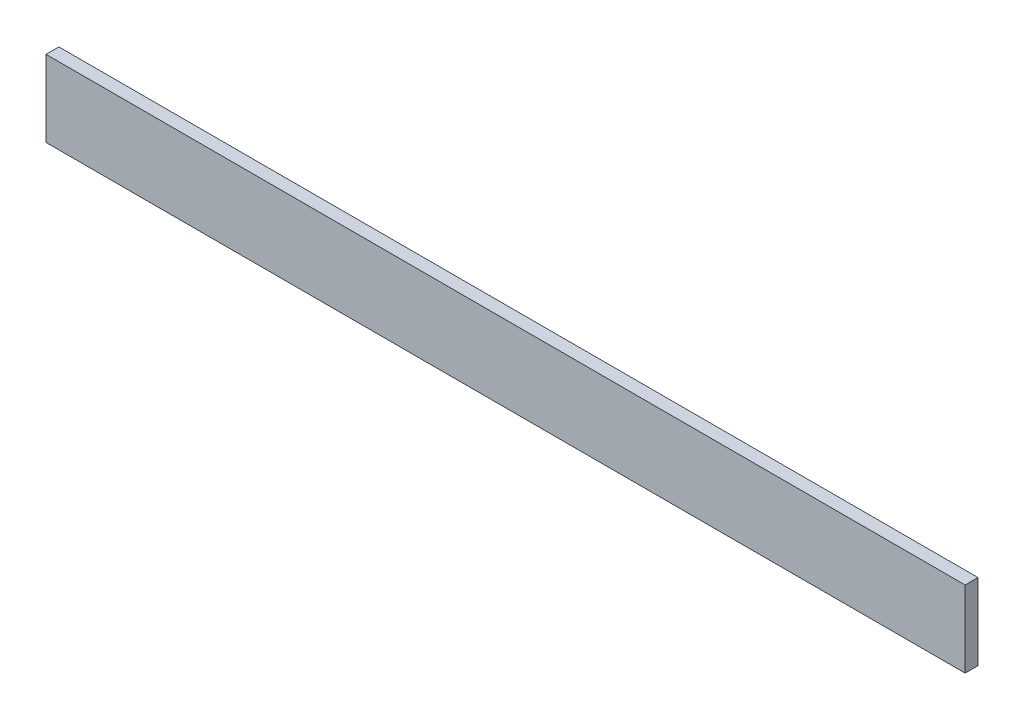
ISO-10303-21;
HEADER;
FILE_DESCRIPTION(('STEP AP214'),'2;1');
FILE_NAME('part.step','',(''),(''),'','','');
FILE_SCHEMA(('AUTOMOTIVE_DESIGN { 1 0 10303 214 1 1 1 1 }'));
ENDSEC;
DATA;
#1=APPLICATION_CONTEXT('core data for automotive mechanical design processes');
#2=APPLICATION_PROTOCOL_DEFINITION('international standard','automotive_design',2000,#1);
#3=PRODUCT_CONTEXT('',#1,'mechanical');
#4=PRODUCT('Part','Part','',(#3));
#5=PRODUCT_RELATED_PRODUCT_CATEGORY('part','',(#4));
#6=PRODUCT_DEFINITION_FORMATION('','',#4);
#7=PRODUCT_DEFINITION_CONTEXT('part definition',#1,'design');
#8=PRODUCT_DEFINITION('design','',#6,#7);
#9=PRODUCT_DEFINITION_SHAPE('','',#8);
#10=(LENGTH_UNIT() NAMED_UNIT(*) SI_UNIT(.MILLI.,.METRE.));
#11=(NAMED_UNIT(*) PLANE_ANGLE_UNIT() SI_UNIT($,.RADIAN.));
#12=(NAMED_UNIT(*) SI_UNIT($,.STERADIAN.) SOLID_ANGLE_UNIT());
#13=UNCERTAINTY_MEASURE_WITH_UNIT(LENGTH_MEASURE(1.E-05),#10,'distance_accuracy_value','');
#14=(GEOMETRIC_REPRESENTATION_CONTEXT(3) GLOBAL_UNCERTAINTY_ASSIGNED_CONTEXT((#13)) GLOBAL_UNIT_ASSIGNED_CONTEXT((#10,
#11,#12)) REPRESENTATION_CONTEXT('',''));
#15=CARTESIAN_POINT('',(0.,0.,0.));
#16=DIRECTION('',(0.,0.,1.));
#17=DIRECTION('',(1.,0.,0.));
#18=AXIS2_PLACEMENT_3D('',#15,#16,#17);
#19=CARTESIAN_POINT('',(107.061,8.89,3.));
#20=DIRECTION('',(-1.,0.,0.));
#21=DIRECTION('',(0.,-1.,0.));
#22=AXIS2_PLACEMENT_3D('',#19,#20,#21);
#23=PLANE('',#22);
#24=DIRECTION('',(0.,1.,0.));
#25=VECTOR('',#24,1.);
#26=CARTESIAN_POINT('',(107.061,8.89,0.));
#27=LINE('',#26,#25);
#28=CARTESIAN_POINT('',(107.061,-8.89,0.));
#29=VERTEX_POINT('',#28);
#30=CARTESIAN_POINT('',(107.061,8.89,0.));
#31=VERTEX_POINT('',#30);
#32=EDGE_CURVE('E95',#29,#31,#27,.T.);
#33=ORIENTED_EDGE('',*,*,#32,.T.);
#34=DIRECTION('',(0.,0.,-1.));
#35=VECTOR('',#34,1.);
#36=CARTESIAN_POINT('',(107.061,8.89,3.));
#37=LINE('',#36,#35);
#38=CARTESIAN_POINT('',(107.061,8.89,3.));
#39=VERTEX_POINT('',#38);
#40=EDGE_CURVE('E11',#39,#31,#37,.T.);
#41=ORIENTED_EDGE('',*,*,#40,.F.);
#42=DIRECTION('',(0.,1.,0.));
#43=VECTOR('',#42,1.);
#44=CARTESIAN_POINT('',(107.061,8.89,3.));
#45=LINE('',#44,#43);
#46=CARTESIAN_POINT('',(107.061,-8.89,3.));
#47=VERTEX_POINT('',#46);
#48=EDGE_CURVE('E83',#47,#39,#45,.T.);
#49=ORIENTED_EDGE('',*,*,#48,.F.);
#50=DIRECTION('',(0.,0.,-1.));
#51=VECTOR('',#50,1.);
#52=CARTESIAN_POINT('',(107.061,-8.89,3.));
#53=LINE('',#52,#51);
#54=EDGE_CURVE('E91',#47,#29,#53,.T.);
#55=ORIENTED_EDGE('',*,*,#54,.T.);
#56=EDGE_LOOP('',(#33,#41,#49,#55));
#57=FACE_BOUND('',#56,.T.);
#58=ADVANCED_FACE('F32',(#57),#23,.F.);
#59=CARTESIAN_POINT('',(-107.061,8.89,3.));
#60=DIRECTION('',(0.,-1.,0.));
#61=DIRECTION('',(0.,0.,-1.));
#62=AXIS2_PLACEMENT_3D('',#59,#60,#61);
#63=PLANE('',#62);
#64=DIRECTION('',(-1.,0.,0.));
#65=VECTOR('',#64,1.);
#66=CARTESIAN_POINT('',(-107.061,8.89,0.));
#67=LINE('',#66,#65);
#68=CARTESIAN_POINT('',(-107.061,8.89,0.));
#69=VERTEX_POINT('',#68);
#70=EDGE_CURVE('E87',#31,#69,#67,.T.);
#71=ORIENTED_EDGE('',*,*,#70,.T.);
#72=DIRECTION('',(0.,0.,-1.));
#73=VECTOR('',#72,1.);
#74=CARTESIAN_POINT('',(-107.061,8.89,3.));
#75=LINE('',#74,#73);
#76=CARTESIAN_POINT('',(-107.061,8.89,3.));
#77=VERTEX_POINT('',#76);
#78=EDGE_CURVE('E40',#77,#69,#75,.T.);
#79=ORIENTED_EDGE('',*,*,#78,.F.);
#80=DIRECTION('',(-1.,0.,0.));
#81=VECTOR('',#80,1.);
#82=CARTESIAN_POINT('',(-107.061,8.89,3.));
#83=LINE('',#82,#81);
#84=EDGE_CURVE('E78',#39,#77,#83,.T.);
#85=ORIENTED_EDGE('',*,*,#84,.F.);
#86=ORIENTED_EDGE('',*,*,#40,.T.);
#87=EDGE_LOOP('',(#71,#79,#85,#86));
#88=FACE_BOUND('',#87,.T.);
#89=ADVANCED_FACE('F86',(#88),#63,.F.);
#90=CARTESIAN_POINT('',(-107.061,8.89,3.));
#91=DIRECTION('',(1.,0.,0.));
#92=DIRECTION('',(0.,1.,0.));
#93=AXIS2_PLACEMENT_3D('',#90,#91,#92);
#94=PLANE('',#93);
#95=DIRECTION('',(0.,-1.,0.));
#96=VECTOR('',#95,1.);
#97=CARTESIAN_POINT('',(-107.061,8.89,0.));
#98=LINE('',#97,#96);
#99=CARTESIAN_POINT('',(-107.061,-8.89,0.));
#100=VERTEX_POINT('',#99);
#101=EDGE_CURVE('E65',#69,#100,#98,.T.);
#102=ORIENTED_EDGE('',*,*,#101,.T.);
#103=DIRECTION('',(0.,0.,-1.));
#104=VECTOR('',#103,1.);
#105=CARTESIAN_POINT('',(-107.061,-8.89,3.));
#106=LINE('',#105,#104);
#107=CARTESIAN_POINT('',(-107.061,-8.89,3.));
#108=VERTEX_POINT('',#107);
#109=EDGE_CURVE('E88',#108,#100,#106,.T.);
#110=ORIENTED_EDGE('',*,*,#109,.F.);
#111=DIRECTION('',(0.,-1.,0.));
#112=VECTOR('',#111,1.);
#113=CARTESIAN_POINT('',(-107.061,8.89,3.));
#114=LINE('',#113,#112);
#115=EDGE_CURVE('E81',#77,#108,#114,.T.);
#116=ORIENTED_EDGE('',*,*,#115,.F.);
#117=ORIENTED_EDGE('',*,*,#78,.T.);
#118=EDGE_LOOP('',(#102,#110,#116,#117));
#119=FACE_BOUND('',#118,.T.);
#120=ADVANCED_FACE('F89',(#119),#94,.F.);
#121=CARTESIAN_POINT('',(-107.061,-8.89,3.));
#122=DIRECTION('',(0.,1.,0.));
#123=DIRECTION('',(0.,0.,1.));
#124=AXIS2_PLACEMENT_3D('',#121,#122,#123);
#125=PLANE('',#124);
#126=DIRECTION('',(1.,0.,0.));
#127=VECTOR('',#126,1.);
#128=CARTESIAN_POINT('',(-107.061,-8.89,0.));
#129=LINE('',#128,#127);
#130=EDGE_CURVE('E71',#100,#29,#129,.T.);
#131=ORIENTED_EDGE('',*,*,#130,.T.);
#132=ORIENTED_EDGE('',*,*,#54,.F.);
#133=DIRECTION('',(1.,0.,0.));
#134=VECTOR('',#133,1.);
#135=CARTESIAN_POINT('',(-107.061,-8.89,3.));
#136=LINE('',#135,#134);
#137=EDGE_CURVE('E48',#108,#47,#136,.T.);
#138=ORIENTED_EDGE('',*,*,#137,.F.);
#139=ORIENTED_EDGE('',*,*,#109,.T.);
#140=EDGE_LOOP('',(#131,#132,#138,#139));
#141=FACE_BOUND('',#140,.T.);
#142=ADVANCED_FACE('F102',(#141),#125,.F.);
#143=CARTESIAN_POINT('',(0.,0.,3.));
#144=DIRECTION('',(0.,0.,1.));
#145=DIRECTION('',(1.,0.,0.));
#146=AXIS2_PLACEMENT_3D('',#143,#144,#145);
#147=PLANE('',#146);
#148=ORIENTED_EDGE('',*,*,#48,.T.);
#149=ORIENTED_EDGE('',*,*,#84,.T.);
#150=ORIENTED_EDGE('',*,*,#115,.T.);
#151=ORIENTED_EDGE('',*,*,#137,.T.);
#152=EDGE_LOOP('',(#148,#149,#150,#151));
#153=FACE_BOUND('',#152,.T.);
#154=ADVANCED_FACE('F79',(#153),#147,.T.);
#155=CARTESIAN_POINT('',(0.,0.,0.));
#156=DIRECTION('',(0.,0.,1.));
#157=DIRECTION('',(1.,0.,0.));
#158=AXIS2_PLACEMENT_3D('',#155,#156,#157);
#159=PLANE('',#158);
#160=ORIENTED_EDGE('',*,*,#32,.F.);
#161=ORIENTED_EDGE('',*,*,#130,.F.);
#162=ORIENTED_EDGE('',*,*,#101,.F.);
#163=ORIENTED_EDGE('',*,*,#70,.F.);
#164=EDGE_LOOP('',(#160,#161,#162,#163));
#165=FACE_BOUND('',#164,.T.);
#166=ADVANCED_FACE('F105',(#165),#159,.F.);
#167=CLOSED_SHELL('',(#58,#89,#120,#142,#154,#166));
#168=MANIFOLD_SOLID_BREP('B2',#167);
#169=ADVANCED_BREP_SHAPE_REPRESENTATION('',(#18,#168),#14);
#170=SHAPE_DEFINITION_REPRESENTATION(#9,#169);
ENDSEC;
END-ISO-10303-21;
